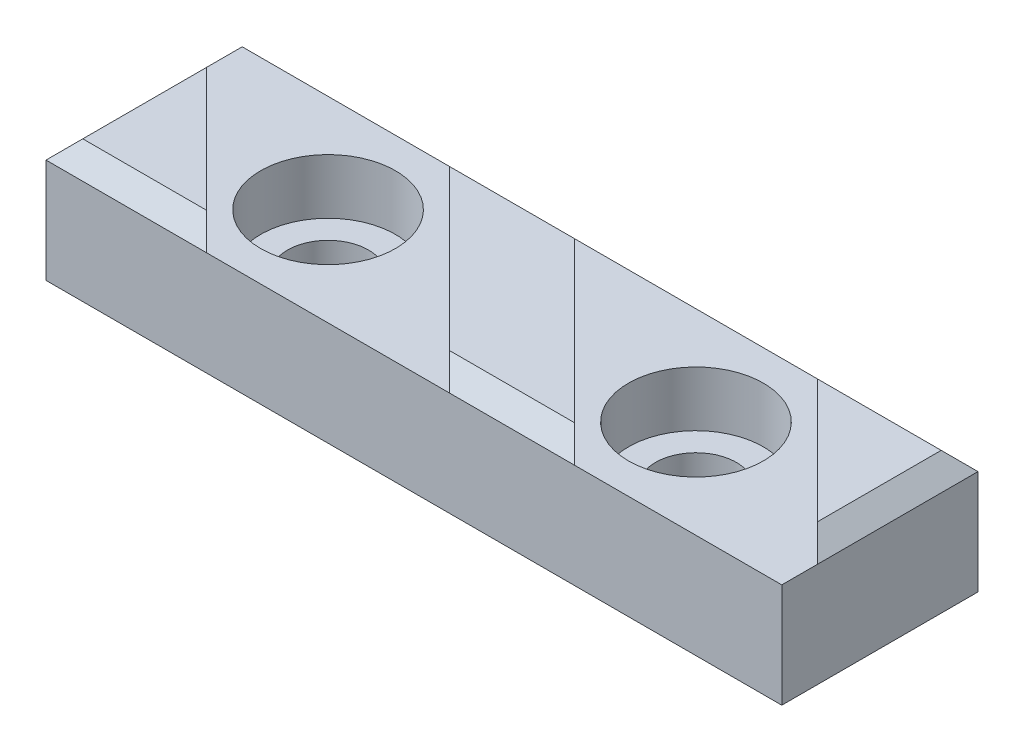
ISO-10303-21;
HEADER;
FILE_DESCRIPTION(('STEP AP214'),'2;1');
FILE_NAME('part.step','',(''),(''),'','','');
FILE_SCHEMA(('AUTOMOTIVE_DESIGN { 1 0 10303 214 1 1 1 1 }'));
ENDSEC;
DATA;
#1=APPLICATION_CONTEXT('core data for automotive mechanical design processes');
#2=APPLICATION_PROTOCOL_DEFINITION('international standard','automotive_design',2000,#1);
#3=PRODUCT_CONTEXT('',#1,'mechanical');
#4=PRODUCT('Part','Part','',(#3));
#5=PRODUCT_RELATED_PRODUCT_CATEGORY('part','',(#4));
#6=PRODUCT_DEFINITION_FORMATION('','',#4);
#7=PRODUCT_DEFINITION_CONTEXT('part definition',#1,'design');
#8=PRODUCT_DEFINITION('design','',#6,#7);
#9=PRODUCT_DEFINITION_SHAPE('','',#8);
#10=(LENGTH_UNIT() NAMED_UNIT(*) SI_UNIT(.MILLI.,.METRE.));
#11=(NAMED_UNIT(*) PLANE_ANGLE_UNIT() SI_UNIT($,.RADIAN.));
#12=(NAMED_UNIT(*) SI_UNIT($,.STERADIAN.) SOLID_ANGLE_UNIT());
#13=UNCERTAINTY_MEASURE_WITH_UNIT(LENGTH_MEASURE(1.E-05),#10,'distance_accuracy_value','');
#14=(GEOMETRIC_REPRESENTATION_CONTEXT(3) GLOBAL_UNCERTAINTY_ASSIGNED_CONTEXT((#13)) GLOBAL_UNIT_ASSIGNED_CONTEXT((#10,
#11,#12)) REPRESENTATION_CONTEXT('',''));
#15=CARTESIAN_POINT('',(0.,0.,0.));
#16=DIRECTION('',(0.,0.,1.));
#17=DIRECTION('',(1.,0.,0.));
#18=AXIS2_PLACEMENT_3D('',#15,#16,#17);
#19=CARTESIAN_POINT('',(0.,8.5,0.));
#20=DIRECTION('',(0.,-1.,0.));
#21=DIRECTION('',(0.,0.,-1.));
#22=AXIS2_PLACEMENT_3D('',#19,#20,#21);
#23=PLANE('',#22);
#24=CARTESIAN_POINT('',(45.,8.5,-7.99999999999999));
#25=DIRECTION('',(0.,1.,0.));
#26=DIRECTION('',(0.,0.,1.));
#27=AXIS2_PLACEMENT_3D('',#24,#25,#26);
#28=CIRCLE('',#27,5.5);
#29=CARTESIAN_POINT('',(45.,8.5,-2.5));
#30=VERTEX_POINT('',#29);
#31=EDGE_CURVE('E221',#30,#30,#28,.T.);
#32=ORIENTED_EDGE('',*,*,#31,.F.);
#33=EDGE_LOOP('',(#32));
#34=FACE_BOUND('',#33,.T.);
#35=DIRECTION('',(0.,0.,-1.));
#36=VECTOR('',#35,1.);
#37=CARTESIAN_POINT('',(60.,8.5,0.));
#38=LINE('',#37,#36);
#39=CARTESIAN_POINT('',(60.,8.5,0.));
#40=VERTEX_POINT('',#39);
#41=CARTESIAN_POINT('',(60.,8.5,-2.89949493661169));
#42=VERTEX_POINT('',#41);
#43=EDGE_CURVE('E161',#40,#42,#38,.T.);
#44=ORIENTED_EDGE('',*,*,#43,.T.);
#45=DIRECTION('',(-0.707106781186549,0.,-0.707106781186546));
#46=VECTOR('',#45,1.);
#47=CARTESIAN_POINT('',(31.4497474683057,8.5,-31.4497474683059));
#48=LINE('',#47,#46);
#49=CARTESIAN_POINT('',(46.8994949366116,8.5,-16.));
#50=VERTEX_POINT('',#49);
#51=EDGE_CURVE('E137',#42,#50,#48,.T.);
#52=ORIENTED_EDGE('',*,*,#51,.T.);
#53=DIRECTION('',(-1.,0.,0.));
#54=VECTOR('',#53,1.);
#55=CARTESIAN_POINT('',(0.,8.5,-16.));
#56=LINE('',#55,#54);
#57=CARTESIAN_POINT('',(27.1005050633883,8.5,-16.));
#58=VERTEX_POINT('',#57);
#59=EDGE_CURVE('E146',#50,#58,#56,.T.);
#60=ORIENTED_EDGE('',*,*,#59,.T.);
#61=DIRECTION('',(0.707106781186549,0.,0.707106781186546));
#62=VECTOR('',#61,1.);
#63=CARTESIAN_POINT('',(21.5502525316941,8.5,-21.5502525316942));
#64=LINE('',#63,#62);
#65=CARTESIAN_POINT('',(43.1005050633883,8.5,0.));
#66=VERTEX_POINT('',#65);
#67=EDGE_CURVE('E195',#58,#66,#64,.T.);
#68=ORIENTED_EDGE('',*,*,#67,.T.);
#69=DIRECTION('',(1.,0.,0.));
#70=VECTOR('',#69,1.);
#71=CARTESIAN_POINT('',(0.,8.5,0.));
#72=LINE('',#71,#70);
#73=EDGE_CURVE('E229',#66,#40,#72,.T.);
#74=ORIENTED_EDGE('',*,*,#73,.T.);
#75=EDGE_LOOP('',(#44,#52,#60,#68,#74));
#76=FACE_BOUND('',#75,.T.);
#77=ADVANCED_FACE('F36',(#34,#76),#23,.F.);
#78=CARTESIAN_POINT('',(0.,8.5,0.));
#79=DIRECTION('',(1.,0.,0.));
#80=DIRECTION('',(0.,0.,-1.));
#81=AXIS2_PLACEMENT_3D('',#78,#79,#80);
#82=PLANE('',#81);
#83=DIRECTION('',(0.,-1.,0.));
#84=VECTOR('',#83,1.);
#85=CARTESIAN_POINT('',(0.,8.5,0.));
#86=LINE('',#85,#84);
#87=CARTESIAN_POINT('',(0.,8.49999999999999,0.));
#88=VERTEX_POINT('',#87);
#89=CARTESIAN_POINT('',(0.,0.,0.));
#90=VERTEX_POINT('',#89);
#91=EDGE_CURVE('E250',#88,#90,#86,.T.);
#92=ORIENTED_EDGE('',*,*,#91,.F.);
#93=DIRECTION('',(0.,0.,-1.));
#94=VECTOR('',#93,1.);
#95=CARTESIAN_POINT('',(0.,8.49999999999999,-13.1005050633883));
#96=LINE('',#95,#94);
#97=CARTESIAN_POINT('',(0.,8.5,-13.1005050633883));
#98=VERTEX_POINT('',#97);
#99=EDGE_CURVE('E265',#88,#98,#96,.T.);
#100=ORIENTED_EDGE('',*,*,#99,.T.);
#101=DIRECTION('',(0.,0.,1.));
#102=VECTOR('',#101,1.);
#103=CARTESIAN_POINT('',(0.,8.5,0.));
#104=LINE('',#103,#102);
#105=CARTESIAN_POINT('',(0.,8.5,-16.));
#106=VERTEX_POINT('',#105);
#107=EDGE_CURVE('E226',#106,#98,#104,.T.);
#108=ORIENTED_EDGE('',*,*,#107,.F.);
#109=DIRECTION('',(0.,-1.,0.));
#110=VECTOR('',#109,1.);
#111=CARTESIAN_POINT('',(0.,8.5,-16.));
#112=LINE('',#111,#110);
#113=CARTESIAN_POINT('',(0.,0.,-16.));
#114=VERTEX_POINT('',#113);
#115=EDGE_CURVE('E156',#106,#114,#112,.T.);
#116=ORIENTED_EDGE('',*,*,#115,.T.);
#117=DIRECTION('',(0.,0.,1.));
#118=VECTOR('',#117,1.);
#119=CARTESIAN_POINT('',(0.,0.,0.));
#120=LINE('',#119,#118);
#121=EDGE_CURVE('E217',#114,#90,#120,.T.);
#122=ORIENTED_EDGE('',*,*,#121,.T.);
#123=EDGE_LOOP('',(#92,#100,#108,#116,#122));
#124=FACE_BOUND('',#123,.T.);
#125=ADVANCED_FACE('F311',(#124),#82,.F.);
#126=CARTESIAN_POINT('',(0.,8.5,0.));
#127=DIRECTION('',(0.,0.,-1.));
#128=DIRECTION('',(-1.,0.,0.));
#129=AXIS2_PLACEMENT_3D('',#126,#127,#128);
#130=PLANE('',#129);
#131=CARTESIAN_POINT('',(13.1005050633883,8.5,0.));
#132=VERTEX_POINT('',#131);
#133=CARTESIAN_POINT('',(32.8994949366117,8.5,0.));
#134=VERTEX_POINT('',#133);
#135=EDGE_CURVE('E231',#132,#134,#72,.T.);
#136=ORIENTED_EDGE('',*,*,#135,.F.);
#137=DIRECTION('',(-1.,0.,0.));
#138=VECTOR('',#137,1.);
#139=CARTESIAN_POINT('',(0.,8.49999999999999,0.));
#140=LINE('',#139,#138);
#141=EDGE_CURVE('E263',#132,#88,#140,.T.);
#142=ORIENTED_EDGE('',*,*,#141,.T.);
#143=ORIENTED_EDGE('',*,*,#91,.T.);
#144=DIRECTION('',(1.,0.,0.));
#145=VECTOR('',#144,1.);
#146=CARTESIAN_POINT('',(0.,0.,0.));
#147=LINE('',#146,#145);
#148=CARTESIAN_POINT('',(60.,0.,0.));
#149=VERTEX_POINT('',#148);
#150=EDGE_CURVE('E237',#90,#149,#147,.T.);
#151=ORIENTED_EDGE('',*,*,#150,.T.);
#152=DIRECTION('',(0.,-1.,0.));
#153=VECTOR('',#152,1.);
#154=CARTESIAN_POINT('',(60.,8.5,0.));
#155=LINE('',#154,#153);
#156=EDGE_CURVE('E247',#40,#149,#155,.T.);
#157=ORIENTED_EDGE('',*,*,#156,.F.);
#158=ORIENTED_EDGE('',*,*,#73,.F.);
#159=DIRECTION('',(-1.,0.,0.));
#160=VECTOR('',#159,1.);
#161=CARTESIAN_POINT('',(32.8994949366117,8.49999999999999,0.));
#162=LINE('',#161,#160);
#163=EDGE_CURVE('E261',#66,#134,#162,.T.);
#164=ORIENTED_EDGE('',*,*,#163,.T.);
#165=EDGE_LOOP('',(#136,#142,#143,#151,#157,#158,#164));
#166=FACE_BOUND('',#165,.T.);
#167=ADVANCED_FACE('F292',(#166),#130,.F.);
#168=CARTESIAN_POINT('',(60.,8.5,0.));
#169=DIRECTION('',(-1.,0.,0.));
#170=DIRECTION('',(0.,0.,1.));
#171=AXIS2_PLACEMENT_3D('',#168,#169,#170);
#172=PLANE('',#171);
#173=DIRECTION('',(0.,-1.,0.));
#174=VECTOR('',#173,1.);
#175=CARTESIAN_POINT('',(60.,8.5,-16.));
#176=LINE('',#175,#174);
#177=CARTESIAN_POINT('',(60.,8.49999999999999,-16.));
#178=VERTEX_POINT('',#177);
#179=CARTESIAN_POINT('',(60.,0.,-16.));
#180=VERTEX_POINT('',#179);
#181=EDGE_CURVE('E245',#178,#180,#176,.T.);
#182=ORIENTED_EDGE('',*,*,#181,.F.);
#183=DIRECTION('',(0.,0.,1.));
#184=VECTOR('',#183,1.);
#185=CARTESIAN_POINT('',(60.,8.49999999999999,-2.89949493661169));
#186=LINE('',#185,#184);
#187=EDGE_CURVE('E142',#178,#42,#186,.T.);
#188=ORIENTED_EDGE('',*,*,#187,.T.);
#189=ORIENTED_EDGE('',*,*,#43,.F.);
#190=ORIENTED_EDGE('',*,*,#156,.T.);
#191=DIRECTION('',(0.,0.,-1.));
#192=VECTOR('',#191,1.);
#193=CARTESIAN_POINT('',(60.,0.,0.));
#194=LINE('',#193,#192);
#195=EDGE_CURVE('E239',#149,#180,#194,.T.);
#196=ORIENTED_EDGE('',*,*,#195,.T.);
#197=EDGE_LOOP('',(#182,#188,#189,#190,#196));
#198=FACE_BOUND('',#197,.T.);
#199=ADVANCED_FACE('F296',(#198),#172,.F.);
#200=CARTESIAN_POINT('',(0.,8.5,-16.));
#201=DIRECTION('',(0.,0.,1.));
#202=DIRECTION('',(1.,0.,0.));
#203=AXIS2_PLACEMENT_3D('',#200,#201,#202);
#204=PLANE('',#203);
#205=CARTESIAN_POINT('',(16.8994949366116,8.5,-16.));
#206=VERTEX_POINT('',#205);
#207=EDGE_CURVE('E157',#206,#106,#56,.T.);
#208=ORIENTED_EDGE('',*,*,#207,.F.);
#209=DIRECTION('',(1.,0.,0.));
#210=VECTOR('',#209,1.);
#211=CARTESIAN_POINT('',(27.1005050633883,8.49999999999999,-16.));
#212=LINE('',#211,#210);
#213=EDGE_CURVE('E152',#206,#58,#212,.T.);
#214=ORIENTED_EDGE('',*,*,#213,.T.);
#215=ORIENTED_EDGE('',*,*,#59,.F.);
#216=DIRECTION('',(1.,0.,0.));
#217=VECTOR('',#216,1.);
#218=CARTESIAN_POINT('',(60.,8.49999999999999,-16.));
#219=LINE('',#218,#217);
#220=EDGE_CURVE('E149',#50,#178,#219,.T.);
#221=ORIENTED_EDGE('',*,*,#220,.T.);
#222=ORIENTED_EDGE('',*,*,#181,.T.);
#223=DIRECTION('',(-1.,0.,0.));
#224=VECTOR('',#223,1.);
#225=CARTESIAN_POINT('',(0.,0.,-16.));
#226=LINE('',#225,#224);
#227=EDGE_CURVE('E230',#180,#114,#226,.T.);
#228=ORIENTED_EDGE('',*,*,#227,.T.);
#229=ORIENTED_EDGE('',*,*,#115,.F.);
#230=EDGE_LOOP('',(#208,#214,#215,#221,#222,#228,#229));
#231=FACE_BOUND('',#230,.T.);
#232=ADVANCED_FACE('F148',(#231),#204,.F.);
#233=CARTESIAN_POINT('',(15.,8.5,-7.99999999999999));
#234=DIRECTION('',(0.,1.,0.));
#235=DIRECTION('',(0.,0.,1.));
#236=AXIS2_PLACEMENT_3D('',#233,#234,#235);
#237=CIRCLE('',#236,5.5);
#238=CARTESIAN_POINT('',(15.,8.5,-2.5));
#239=VERTEX_POINT('',#238);
#240=EDGE_CURVE('E218',#239,#239,#237,.T.);
#241=ORIENTED_EDGE('',*,*,#240,.F.);
#242=EDGE_LOOP('',(#241));
#243=FACE_BOUND('',#242,.T.);
#244=ORIENTED_EDGE('',*,*,#135,.T.);
#245=DIRECTION('',(-0.707106781186549,0.,-0.707106781186546));
#246=VECTOR('',#245,1.);
#247=CARTESIAN_POINT('',(16.4497474683058,8.5,-16.4497474683059));
#248=LINE('',#247,#246);
#249=EDGE_CURVE('E201',#134,#206,#248,.T.);
#250=ORIENTED_EDGE('',*,*,#249,.T.);
#251=ORIENTED_EDGE('',*,*,#207,.T.);
#252=ORIENTED_EDGE('',*,*,#107,.T.);
#253=DIRECTION('',(0.707106781186549,0.,0.707106781186546));
#254=VECTOR('',#253,1.);
#255=CARTESIAN_POINT('',(6.55025253169414,8.5,-6.55025253169417));
#256=LINE('',#255,#254);
#257=EDGE_CURVE('E204',#98,#132,#256,.T.);
#258=ORIENTED_EDGE('',*,*,#257,.T.);
#259=EDGE_LOOP('',(#244,#250,#251,#252,#258));
#260=FACE_BOUND('',#259,.T.);
#261=ADVANCED_FACE('F314',(#243,#260),#23,.F.);
#262=CARTESIAN_POINT('',(0.,0.,0.));
#263=DIRECTION('',(0.,-1.,0.));
#264=DIRECTION('',(0.,0.,-1.));
#265=AXIS2_PLACEMENT_3D('',#262,#263,#264);
#266=PLANE('',#265);
#267=CARTESIAN_POINT('',(15.,0.,-7.99999999999999));
#268=DIRECTION('',(0.,1.,0.));
#269=DIRECTION('',(0.,0.,1.));
#270=AXIS2_PLACEMENT_3D('',#267,#268,#269);
#271=CIRCLE('',#270,3.3);
#272=CARTESIAN_POINT('',(15.,0.,-4.69999999999999));
#273=VERTEX_POINT('',#272);
#274=EDGE_CURVE('E162',#273,#273,#271,.T.);
#275=ORIENTED_EDGE('',*,*,#274,.T.);
#276=EDGE_LOOP('',(#275));
#277=FACE_BOUND('',#276,.T.);
#278=CARTESIAN_POINT('',(45.,0.,-7.99999999999999));
#279=DIRECTION('',(0.,1.,0.));
#280=DIRECTION('',(0.,0.,1.));
#281=AXIS2_PLACEMENT_3D('',#278,#279,#280);
#282=CIRCLE('',#281,3.3);
#283=CARTESIAN_POINT('',(45.,0.,-4.7));
#284=VERTEX_POINT('',#283);
#285=EDGE_CURVE('E186',#284,#284,#282,.T.);
#286=ORIENTED_EDGE('',*,*,#285,.T.);
#287=EDGE_LOOP('',(#286));
#288=FACE_BOUND('',#287,.T.);
#289=ORIENTED_EDGE('',*,*,#121,.F.);
#290=ORIENTED_EDGE('',*,*,#227,.F.);
#291=ORIENTED_EDGE('',*,*,#195,.F.);
#292=ORIENTED_EDGE('',*,*,#150,.F.);
#293=EDGE_LOOP('',(#289,#290,#291,#292));
#294=FACE_BOUND('',#293,.T.);
#295=ADVANCED_FACE('F324',(#277,#288,#294),#266,.T.);
#296=CARTESIAN_POINT('',(45.,4.,-7.99999999999999));
#297=DIRECTION('',(0.,1.,0.));
#298=DIRECTION('',(0.,0.,1.));
#299=AXIS2_PLACEMENT_3D('',#296,#297,#298);
#300=CYLINDRICAL_SURFACE('',#299,5.5);
#301=CARTESIAN_POINT('',(45.,4.,-7.99999999999999));
#302=DIRECTION('',(0.,1.,0.));
#303=DIRECTION('',(0.,0.,1.));
#304=AXIS2_PLACEMENT_3D('',#301,#302,#303);
#305=CIRCLE('',#304,5.5);
#306=CARTESIAN_POINT('',(45.,4.,-2.5));
#307=VERTEX_POINT('',#306);
#308=EDGE_CURVE('E211',#307,#307,#305,.T.);
#309=ORIENTED_EDGE('',*,*,#308,.F.);
#310=EDGE_LOOP('',(#309));
#311=FACE_BOUND('',#310,.T.);
#312=ORIENTED_EDGE('',*,*,#31,.T.);
#313=EDGE_LOOP('',(#312));
#314=FACE_BOUND('',#313,.T.);
#315=ADVANCED_FACE('F330',(#311,#314),#300,.F.);
#316=CARTESIAN_POINT('',(45.,4.,-7.99999999999999));
#317=DIRECTION('',(0.,1.,0.));
#318=DIRECTION('',(0.,0.,1.));
#319=AXIS2_PLACEMENT_3D('',#316,#317,#318);
#320=PLANE('',#319);
#321=CARTESIAN_POINT('',(45.,4.,-7.99999999999999));
#322=DIRECTION('',(0.,1.,0.));
#323=DIRECTION('',(0.,0.,1.));
#324=AXIS2_PLACEMENT_3D('',#321,#322,#323);
#325=CIRCLE('',#324,3.3);
#326=CARTESIAN_POINT('',(45.,4.,-4.7));
#327=VERTEX_POINT('',#326);
#328=EDGE_CURVE('E180',#327,#327,#325,.T.);
#329=ORIENTED_EDGE('',*,*,#328,.F.);
#330=EDGE_LOOP('',(#329));
#331=FACE_BOUND('',#330,.T.);
#332=ORIENTED_EDGE('',*,*,#308,.T.);
#333=EDGE_LOOP('',(#332));
#334=FACE_BOUND('',#333,.T.);
#335=ADVANCED_FACE('F518',(#331,#334),#320,.T.);
#336=CARTESIAN_POINT('',(15.,4.,-7.99999999999999));
#337=DIRECTION('',(0.,1.,0.));
#338=DIRECTION('',(0.,0.,1.));
#339=AXIS2_PLACEMENT_3D('',#336,#337,#338);
#340=CYLINDRICAL_SURFACE('',#339,5.5);
#341=CARTESIAN_POINT('',(15.,4.,-7.99999999999999));
#342=DIRECTION('',(0.,1.,0.));
#343=DIRECTION('',(0.,0.,1.));
#344=AXIS2_PLACEMENT_3D('',#341,#342,#343);
#345=CIRCLE('',#344,5.5);
#346=CARTESIAN_POINT('',(15.,4.,-2.5));
#347=VERTEX_POINT('',#346);
#348=EDGE_CURVE('E214',#347,#347,#345,.T.);
#349=ORIENTED_EDGE('',*,*,#348,.F.);
#350=EDGE_LOOP('',(#349));
#351=FACE_BOUND('',#350,.T.);
#352=ORIENTED_EDGE('',*,*,#240,.T.);
#353=EDGE_LOOP('',(#352));
#354=FACE_BOUND('',#353,.T.);
#355=ADVANCED_FACE('F510',(#351,#354),#340,.F.);
#356=CARTESIAN_POINT('',(15.,4.,-7.99999999999999));
#357=DIRECTION('',(0.,1.,0.));
#358=DIRECTION('',(0.,0.,1.));
#359=AXIS2_PLACEMENT_3D('',#356,#357,#358);
#360=PLANE('',#359);
#361=CARTESIAN_POINT('',(15.,4.,-7.99999999999999));
#362=DIRECTION('',(0.,1.,0.));
#363=DIRECTION('',(0.,0.,1.));
#364=AXIS2_PLACEMENT_3D('',#361,#362,#363);
#365=CIRCLE('',#364,3.3);
#366=CARTESIAN_POINT('',(15.,4.,-4.69999999999999));
#367=VERTEX_POINT('',#366);
#368=EDGE_CURVE('E191',#367,#367,#365,.T.);
#369=ORIENTED_EDGE('',*,*,#368,.F.);
#370=EDGE_LOOP('',(#369));
#371=FACE_BOUND('',#370,.T.);
#372=ORIENTED_EDGE('',*,*,#348,.T.);
#373=EDGE_LOOP('',(#372));
#374=FACE_BOUND('',#373,.T.);
#375=ADVANCED_FACE('F444',(#371,#374),#360,.T.);
#376=CARTESIAN_POINT('',(6.55025253169414,10.,-6.55025253169417));
#377=DIRECTION('',(0.707106781186546,0.,-0.707106781186549));
#378=DIRECTION('',(-0.707106781186549,0.,-0.707106781186546));
#379=AXIS2_PLACEMENT_3D('',#376,#377,#378);
#380=PLANE('',#379);
#381=DIRECTION('',(0.707106781186549,0.,0.707106781186546));
#382=VECTOR('',#381,1.);
#383=CARTESIAN_POINT('',(6.55025253169414,10.,-6.55025253169417));
#384=LINE('',#383,#382);
#385=CARTESIAN_POINT('',(1.5,10.,-11.6005050633883));
#386=VERTEX_POINT('',#385);
#387=CARTESIAN_POINT('',(11.6005050633883,10.,-1.5));
#388=VERTEX_POINT('',#387);
#389=EDGE_CURVE('E208',#386,#388,#384,.T.);
#390=ORIENTED_EDGE('',*,*,#389,.T.);
#391=DIRECTION('',(0.577350269189626,-0.577350269189627,0.577350269189624));
#392=VECTOR('',#391,1.);
#393=CARTESIAN_POINT('',(8.23367004225888,13.3668350211295,-4.86683502112944));
#394=LINE('',#393,#392);
#395=EDGE_CURVE('E259',#388,#132,#394,.T.);
#396=ORIENTED_EDGE('',*,*,#395,.T.);
#397=ORIENTED_EDGE('',*,*,#257,.F.);
#398=DIRECTION('',(0.577350269189626,0.577350269189628,0.577350269189623));
#399=VECTOR('',#398,1.);
#400=CARTESIAN_POINT('',(4.86683502112941,13.3668350211294,-8.23367004225889));
#401=LINE('',#400,#399);
#402=EDGE_CURVE('E257',#98,#386,#401,.T.);
#403=ORIENTED_EDGE('',*,*,#402,.T.);
#404=EDGE_LOOP('',(#390,#396,#397,#403));
#405=FACE_BOUND('',#404,.T.);
#406=ADVANCED_FACE('F343',(#405),#380,.T.);
#407=CARTESIAN_POINT('',(0.,10.,0.));
#408=DIRECTION('',(0.,1.,0.));
#409=DIRECTION('',(0.,0.,1.));
#410=AXIS2_PLACEMENT_3D('',#407,#408,#409);
#411=PLANE('',#410);
#412=DIRECTION('',(0.,0.,1.));
#413=VECTOR('',#412,1.);
#414=CARTESIAN_POINT('',(1.5,10.,0.));
#415=LINE('',#414,#413);
#416=CARTESIAN_POINT('',(1.5,10.,-1.5));
#417=VERTEX_POINT('',#416);
#418=EDGE_CURVE('E252',#386,#417,#415,.T.);
#419=ORIENTED_EDGE('',*,*,#418,.T.);
#420=DIRECTION('',(1.,0.,0.));
#421=VECTOR('',#420,1.);
#422=CARTESIAN_POINT('',(13.1005050633883,10.,-1.5));
#423=LINE('',#422,#421);
#424=EDGE_CURVE('E254',#417,#388,#423,.T.);
#425=ORIENTED_EDGE('',*,*,#424,.T.);
#426=ORIENTED_EDGE('',*,*,#389,.F.);
#427=EDGE_LOOP('',(#419,#425,#426));
#428=FACE_BOUND('',#427,.T.);
#429=ADVANCED_FACE('F341',(#428),#411,.T.);
#430=CARTESIAN_POINT('',(21.5502525316941,10.,-21.5502525316942));
#431=DIRECTION('',(0.707106781186546,0.,-0.707106781186549));
#432=DIRECTION('',(-0.707106781186549,0.,-0.707106781186546));
#433=AXIS2_PLACEMENT_3D('',#430,#431,#432);
#434=PLANE('',#433);
#435=ORIENTED_EDGE('',*,*,#67,.F.);
#436=DIRECTION('',(0.577350269189627,0.577350269189627,0.577350269189624));
#437=VECTOR('',#436,1.);
#438=CARTESIAN_POINT('',(23.9003367089255,5.29983164553721,-19.2001683544628));
#439=LINE('',#438,#437);
#440=CARTESIAN_POINT('',(28.6005050633883,10.,-14.5));
#441=VERTEX_POINT('',#440);
#442=EDGE_CURVE('E173',#58,#441,#439,.T.);
#443=ORIENTED_EDGE('',*,*,#442,.T.);
#444=DIRECTION('',(0.707106781186549,0.,0.707106781186546));
#445=VECTOR('',#444,1.);
#446=CARTESIAN_POINT('',(21.5502525316941,10.,-21.5502525316942));
#447=LINE('',#446,#445);
#448=CARTESIAN_POINT('',(41.6005050633883,10.,-1.5));
#449=VERTEX_POINT('',#448);
#450=EDGE_CURVE('E197',#441,#449,#447,.T.);
#451=ORIENTED_EDGE('',*,*,#450,.T.);
#452=DIRECTION('',(0.577350269189627,-0.577350269189627,0.577350269189624));
#453=VECTOR('',#452,1.);
#454=CARTESIAN_POINT('',(28.2336700422588,23.3668350211295,-14.8668350211294));
#455=LINE('',#454,#453);
#456=EDGE_CURVE('E166',#449,#66,#455,.T.);
#457=ORIENTED_EDGE('',*,*,#456,.T.);
#458=EDGE_LOOP('',(#435,#443,#451,#457));
#459=FACE_BOUND('',#458,.T.);
#460=ADVANCED_FACE('F287',(#459),#434,.T.);
#461=CARTESIAN_POINT('',(16.4497474683058,10.,-16.4497474683059));
#462=DIRECTION('',(-0.707106781186546,0.,0.707106781186549));
#463=DIRECTION('',(0.707106781186549,0.,0.707106781186546));
#464=AXIS2_PLACEMENT_3D('',#461,#462,#463);
#465=PLANE('',#464);
#466=DIRECTION('',(-0.707106781186549,0.,-0.707106781186546));
#467=VECTOR('',#466,1.);
#468=CARTESIAN_POINT('',(16.4497474683058,10.,-16.4497474683059));
#469=LINE('',#468,#467);
#470=CARTESIAN_POINT('',(31.3994949366117,10.,-1.5));
#471=VERTEX_POINT('',#470);
#472=CARTESIAN_POINT('',(18.3994949366116,10.,-14.5));
#473=VERTEX_POINT('',#472);
#474=EDGE_CURVE('E200',#471,#473,#469,.T.);
#475=ORIENTED_EDGE('',*,*,#474,.T.);
#476=DIRECTION('',(-0.577350269189627,-0.577350269189627,-0.577350269189624));
#477=VECTOR('',#476,1.);
#478=CARTESIAN_POINT('',(17.0996632910744,8.70016835446276,-15.7998316455372));
#479=LINE('',#478,#477);
#480=EDGE_CURVE('E164',#473,#206,#479,.T.);
#481=ORIENTED_EDGE('',*,*,#480,.T.);
#482=ORIENTED_EDGE('',*,*,#249,.F.);
#483=DIRECTION('',(-0.577350269189627,0.577350269189627,-0.577350269189624));
#484=VECTOR('',#483,1.);
#485=CARTESIAN_POINT('',(21.4329966244078,19.9664983122039,-11.4664983122039));
#486=LINE('',#485,#484);
#487=EDGE_CURVE('E168',#134,#471,#486,.T.);
#488=ORIENTED_EDGE('',*,*,#487,.T.);
#489=EDGE_LOOP('',(#475,#481,#482,#488));
#490=FACE_BOUND('',#489,.T.);
#491=ADVANCED_FACE('F276',(#490),#465,.T.);
#492=CARTESIAN_POINT('',(0.,10.,0.));
#493=DIRECTION('',(0.,1.,0.));
#494=DIRECTION('',(0.,0.,1.));
#495=AXIS2_PLACEMENT_3D('',#492,#493,#494);
#496=PLANE('',#495);
#497=ORIENTED_EDGE('',*,*,#450,.F.);
#498=DIRECTION('',(-1.,0.,0.));
#499=VECTOR('',#498,1.);
#500=CARTESIAN_POINT('',(16.8994949366116,10.,-14.5));
#501=LINE('',#500,#499);
#502=EDGE_CURVE('E270',#441,#473,#501,.T.);
#503=ORIENTED_EDGE('',*,*,#502,.T.);
#504=ORIENTED_EDGE('',*,*,#474,.F.);
#505=DIRECTION('',(1.,0.,0.));
#506=VECTOR('',#505,1.);
#507=CARTESIAN_POINT('',(43.1005050633883,10.,-1.5));
#508=LINE('',#507,#506);
#509=EDGE_CURVE('E267',#471,#449,#508,.T.);
#510=ORIENTED_EDGE('',*,*,#509,.T.);
#511=EDGE_LOOP('',(#497,#503,#504,#510));
#512=FACE_BOUND('',#511,.T.);
#513=ADVANCED_FACE('F282',(#512),#496,.T.);
#514=CARTESIAN_POINT('',(31.4497474683057,10.,-31.4497474683059));
#515=DIRECTION('',(-0.707106781186546,0.,0.707106781186549));
#516=DIRECTION('',(0.707106781186549,0.,0.707106781186546));
#517=AXIS2_PLACEMENT_3D('',#514,#515,#516);
#518=PLANE('',#517);
#519=ORIENTED_EDGE('',*,*,#51,.F.);
#520=DIRECTION('',(-0.577350269189626,0.577350269189629,-0.577350269189623));
#521=VECTOR('',#520,1.);
#522=CARTESIAN_POINT('',(40.4664983122039,28.0335016877962,-22.4329966244077));
#523=LINE('',#522,#521);
#524=CARTESIAN_POINT('',(58.5,10.,-4.39949493661169));
#525=VERTEX_POINT('',#524);
#526=EDGE_CURVE('E11',#42,#525,#523,.T.);
#527=ORIENTED_EDGE('',*,*,#526,.T.);
#528=DIRECTION('',(-0.707106781186549,0.,-0.707106781186546));
#529=VECTOR('',#528,1.);
#530=CARTESIAN_POINT('',(31.4497474683057,10.,-31.4497474683059));
#531=LINE('',#530,#529);
#532=CARTESIAN_POINT('',(48.3994949366117,10.,-14.5));
#533=VERTEX_POINT('',#532);
#534=EDGE_CURVE('E139',#525,#533,#531,.T.);
#535=ORIENTED_EDGE('',*,*,#534,.T.);
#536=DIRECTION('',(-0.577350269189627,-0.577350269189627,-0.577350269189624));
#537=VECTOR('',#536,1.);
#538=CARTESIAN_POINT('',(37.0996632910744,-1.29983164553728,-25.7998316455372));
#539=LINE('',#538,#537);
#540=EDGE_CURVE('E45',#533,#50,#539,.T.);
#541=ORIENTED_EDGE('',*,*,#540,.T.);
#542=EDGE_LOOP('',(#519,#527,#535,#541));
#543=FACE_BOUND('',#542,.T.);
#544=ADVANCED_FACE('F135',(#543),#518,.T.);
#545=CARTESIAN_POINT('',(0.,10.,0.));
#546=DIRECTION('',(0.,1.,0.));
#547=DIRECTION('',(0.,0.,1.));
#548=AXIS2_PLACEMENT_3D('',#545,#546,#547);
#549=PLANE('',#548);
#550=ORIENTED_EDGE('',*,*,#534,.F.);
#551=DIRECTION('',(0.,0.,-1.));
#552=VECTOR('',#551,1.);
#553=CARTESIAN_POINT('',(58.5,10.,-16.));
#554=LINE('',#553,#552);
#555=CARTESIAN_POINT('',(58.5,10.,-14.5));
#556=VERTEX_POINT('',#555);
#557=EDGE_CURVE('E176',#525,#556,#554,.T.);
#558=ORIENTED_EDGE('',*,*,#557,.T.);
#559=DIRECTION('',(-1.,0.,0.));
#560=VECTOR('',#559,1.);
#561=CARTESIAN_POINT('',(46.8994949366116,10.,-14.5));
#562=LINE('',#561,#560);
#563=EDGE_CURVE('E59',#556,#533,#562,.T.);
#564=ORIENTED_EDGE('',*,*,#563,.T.);
#565=EDGE_LOOP('',(#550,#558,#564));
#566=FACE_BOUND('',#565,.T.);
#567=ADVANCED_FACE('F298',(#566),#549,.T.);
#568=CARTESIAN_POINT('',(45.,0.,-7.99999999999999));
#569=DIRECTION('',(0.,1.,0.));
#570=DIRECTION('',(0.,0.,1.));
#571=AXIS2_PLACEMENT_3D('',#568,#569,#570);
#572=CYLINDRICAL_SURFACE('',#571,3.3);
#573=ORIENTED_EDGE('',*,*,#285,.F.);
#574=EDGE_LOOP('',(#573));
#575=FACE_BOUND('',#574,.T.);
#576=ORIENTED_EDGE('',*,*,#328,.T.);
#577=EDGE_LOOP('',(#576));
#578=FACE_BOUND('',#577,.T.);
#579=ADVANCED_FACE('F300',(#575,#578),#572,.F.);
#580=CARTESIAN_POINT('',(15.,0.,-7.99999999999999));
#581=DIRECTION('',(0.,1.,0.));
#582=DIRECTION('',(0.,0.,1.));
#583=AXIS2_PLACEMENT_3D('',#580,#581,#582);
#584=CYLINDRICAL_SURFACE('',#583,3.3);
#585=ORIENTED_EDGE('',*,*,#274,.F.);
#586=EDGE_LOOP('',(#585));
#587=FACE_BOUND('',#586,.T.);
#588=ORIENTED_EDGE('',*,*,#368,.T.);
#589=EDGE_LOOP('',(#588));
#590=FACE_BOUND('',#589,.T.);
#591=ADVANCED_FACE('F306',(#587,#590),#584,.F.);
#592=CARTESIAN_POINT('',(1.5,10.,0.));
#593=DIRECTION('',(-0.707106781186549,0.707106781186546,0.));
#594=DIRECTION('',(0.,0.,-1.));
#595=AXIS2_PLACEMENT_3D('',#592,#593,#594);
#596=PLANE('',#595);
#597=ORIENTED_EDGE('',*,*,#402,.F.);
#598=ORIENTED_EDGE('',*,*,#99,.F.);
#599=DIRECTION('',(0.577350269189625,0.577350269189628,-0.577350269189625));
#600=VECTOR('',#599,1.);
#601=CARTESIAN_POINT('',(1.,9.5,-1.));
#602=LINE('',#601,#600);
#603=EDGE_CURVE('E178',#417,#88,#602,.F.);
#604=ORIENTED_EDGE('',*,*,#603,.F.);
#605=ORIENTED_EDGE('',*,*,#418,.F.);
#606=EDGE_LOOP('',(#597,#598,#604,#605));
#607=FACE_BOUND('',#606,.T.);
#608=ADVANCED_FACE('F347',(#607),#596,.T.);
#609=CARTESIAN_POINT('',(0.,10.,-1.5));
#610=DIRECTION('',(0.,0.707106781186546,0.707106781186549));
#611=DIRECTION('',(-1.,0.,0.));
#612=AXIS2_PLACEMENT_3D('',#609,#610,#611);
#613=PLANE('',#612);
#614=ORIENTED_EDGE('',*,*,#603,.T.);
#615=ORIENTED_EDGE('',*,*,#141,.F.);
#616=ORIENTED_EDGE('',*,*,#395,.F.);
#617=ORIENTED_EDGE('',*,*,#424,.F.);
#618=EDGE_LOOP('',(#614,#615,#616,#617));
#619=FACE_BOUND('',#618,.T.);
#620=ADVANCED_FACE('F337',(#619),#613,.T.);
#621=CARTESIAN_POINT('',(0.,10.,-14.5));
#622=DIRECTION('',(0.,0.707106781186546,-0.707106781186549));
#623=DIRECTION('',(1.,0.,0.));
#624=AXIS2_PLACEMENT_3D('',#621,#622,#623);
#625=PLANE('',#624);
#626=ORIENTED_EDGE('',*,*,#442,.F.);
#627=ORIENTED_EDGE('',*,*,#213,.F.);
#628=ORIENTED_EDGE('',*,*,#480,.F.);
#629=ORIENTED_EDGE('',*,*,#502,.F.);
#630=EDGE_LOOP('',(#626,#627,#628,#629));
#631=FACE_BOUND('',#630,.T.);
#632=ADVANCED_FACE('F354',(#631),#625,.T.);
#633=CARTESIAN_POINT('',(0.,10.,-1.5));
#634=DIRECTION('',(0.,0.707106781186546,0.707106781186549));
#635=DIRECTION('',(-1.,0.,0.));
#636=AXIS2_PLACEMENT_3D('',#633,#634,#635);
#637=PLANE('',#636);
#638=ORIENTED_EDGE('',*,*,#487,.F.);
#639=ORIENTED_EDGE('',*,*,#163,.F.);
#640=ORIENTED_EDGE('',*,*,#456,.F.);
#641=ORIENTED_EDGE('',*,*,#509,.F.);
#642=EDGE_LOOP('',(#638,#639,#640,#641));
#643=FACE_BOUND('',#642,.T.);
#644=ADVANCED_FACE('F284',(#643),#637,.T.);
#645=CARTESIAN_POINT('',(0.,10.,-14.5));
#646=DIRECTION('',(0.,0.707106781186546,-0.707106781186549));
#647=DIRECTION('',(1.,0.,0.));
#648=AXIS2_PLACEMENT_3D('',#645,#646,#647);
#649=PLANE('',#648);
#650=ORIENTED_EDGE('',*,*,#540,.F.);
#651=ORIENTED_EDGE('',*,*,#563,.F.);
#652=DIRECTION('',(0.577350269189625,-0.577350269189628,-0.577350269189625));
#653=VECTOR('',#652,1.);
#654=CARTESIAN_POINT('',(39.0000000000001,29.5,4.99999999999994));
#655=LINE('',#654,#653);
#656=EDGE_CURVE('E40',#178,#556,#655,.F.);
#657=ORIENTED_EDGE('',*,*,#656,.F.);
#658=ORIENTED_EDGE('',*,*,#220,.F.);
#659=EDGE_LOOP('',(#650,#651,#657,#658));
#660=FACE_BOUND('',#659,.T.);
#661=ADVANCED_FACE('F38',(#660),#649,.T.);
#662=CARTESIAN_POINT('',(58.5,10.,0.));
#663=DIRECTION('',(0.707106781186549,0.707106781186546,0.));
#664=DIRECTION('',(0.,0.,1.));
#665=AXIS2_PLACEMENT_3D('',#662,#663,#664);
#666=PLANE('',#665);
#667=ORIENTED_EDGE('',*,*,#526,.F.);
#668=ORIENTED_EDGE('',*,*,#187,.F.);
#669=ORIENTED_EDGE('',*,*,#656,.T.);
#670=ORIENTED_EDGE('',*,*,#557,.F.);
#671=EDGE_LOOP('',(#667,#668,#669,#670));
#672=FACE_BOUND('',#671,.T.);
#673=ADVANCED_FACE('F297',(#672),#666,.T.);
#674=CLOSED_SHELL('',(#77,#125,#167,#199,#232,#261,#295,#315,#335,#355,#375,#406,#429,#460,#491,
#513,#544,#567,#579,#591,#608,#620,#632,#644,#661,#673));
#675=MANIFOLD_SOLID_BREP('B2',#674);
#676=ADVANCED_BREP_SHAPE_REPRESENTATION('',(#18,#675),#14);
#677=SHAPE_DEFINITION_REPRESENTATION(#9,#676);
ENDSEC;
END-ISO-10303-21;
